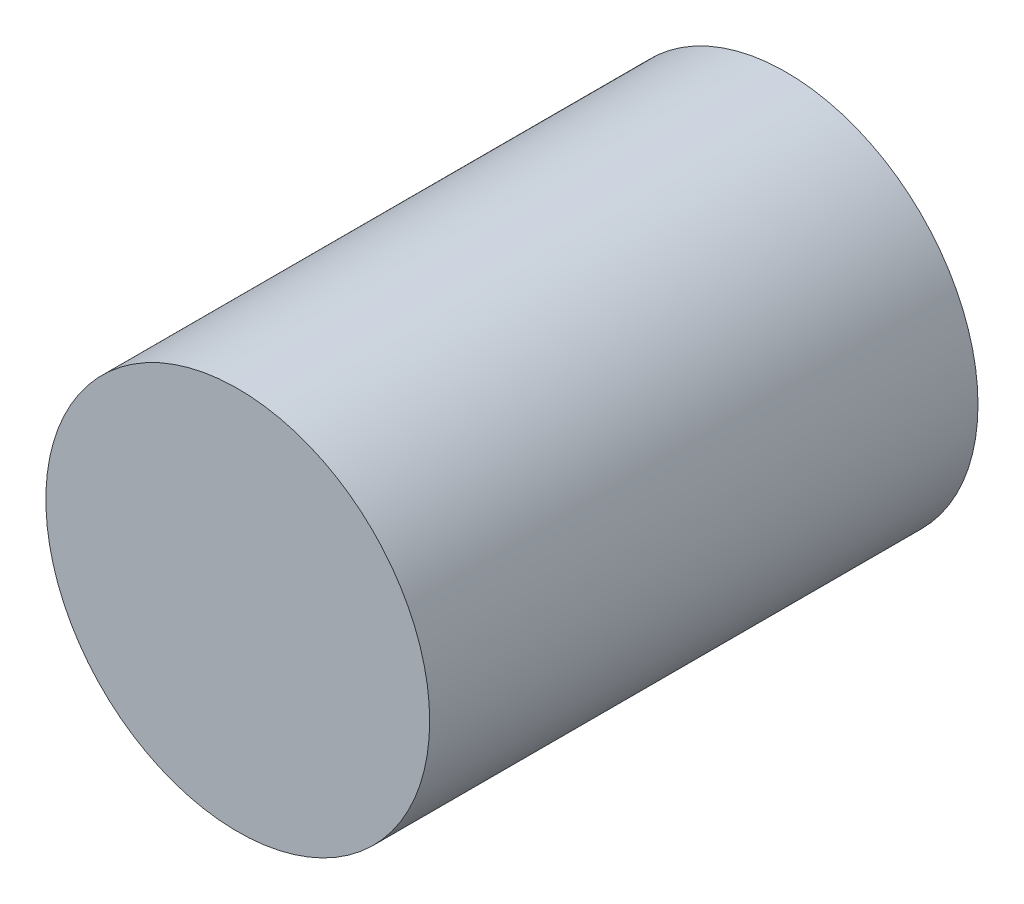
ISO-10303-21;
HEADER;
FILE_DESCRIPTION(('STEP AP214'),'2;1');
FILE_NAME('part.step','',(''),(''),'','','');
FILE_SCHEMA(('AUTOMOTIVE_DESIGN { 1 0 10303 214 1 1 1 1 }'));
ENDSEC;
DATA;
#1=APPLICATION_CONTEXT('core data for automotive mechanical design processes');
#2=APPLICATION_PROTOCOL_DEFINITION('international standard','automotive_design',2000,#1);
#3=PRODUCT_CONTEXT('',#1,'mechanical');
#4=PRODUCT('Part','Part','',(#3));
#5=PRODUCT_RELATED_PRODUCT_CATEGORY('part','',(#4));
#6=PRODUCT_DEFINITION_FORMATION('','',#4);
#7=PRODUCT_DEFINITION_CONTEXT('part definition',#1,'design');
#8=PRODUCT_DEFINITION('design','',#6,#7);
#9=PRODUCT_DEFINITION_SHAPE('','',#8);
#10=(LENGTH_UNIT() NAMED_UNIT(*) SI_UNIT(.MILLI.,.METRE.));
#11=(NAMED_UNIT(*) PLANE_ANGLE_UNIT() SI_UNIT($,.RADIAN.));
#12=(NAMED_UNIT(*) SI_UNIT($,.STERADIAN.) SOLID_ANGLE_UNIT());
#13=UNCERTAINTY_MEASURE_WITH_UNIT(LENGTH_MEASURE(1.E-05),#10,'distance_accuracy_value','');
#14=(GEOMETRIC_REPRESENTATION_CONTEXT(3) GLOBAL_UNCERTAINTY_ASSIGNED_CONTEXT((#13)) GLOBAL_UNIT_ASSIGNED_CONTEXT((#10,
#11,#12)) REPRESENTATION_CONTEXT('',''));
#15=CARTESIAN_POINT('',(0.,0.,0.));
#16=DIRECTION('',(0.,0.,1.));
#17=DIRECTION('',(1.,0.,0.));
#18=AXIS2_PLACEMENT_3D('',#15,#16,#17);
#19=CARTESIAN_POINT('',(0.,0.,10.));
#20=DIRECTION('',(0.,0.,-1.));
#21=DIRECTION('',(-1.,0.,0.));
#22=AXIS2_PLACEMENT_3D('',#19,#20,#21);
#23=CYLINDRICAL_SURFACE('',#22,3.5);
#24=CARTESIAN_POINT('',(0.,0.,10.));
#25=DIRECTION('',(0.,0.,1.));
#26=DIRECTION('',(1.,0.,0.));
#27=AXIS2_PLACEMENT_3D('',#24,#25,#26);
#28=CIRCLE('',#27,3.5);
#29=CARTESIAN_POINT('',(3.5,0.,10.));
#30=VERTEX_POINT('',#29);
#31=EDGE_CURVE('E10',#30,#30,#28,.T.);
#32=ORIENTED_EDGE('',*,*,#31,.F.);
#33=EDGE_LOOP('',(#32));
#34=FACE_BOUND('',#33,.T.);
#35=CARTESIAN_POINT('',(0.,0.,0.));
#36=DIRECTION('',(0.,0.,1.));
#37=DIRECTION('',(1.,0.,0.));
#38=AXIS2_PLACEMENT_3D('',#35,#36,#37);
#39=CIRCLE('',#38,3.5);
#40=CARTESIAN_POINT('',(3.5,0.,0.));
#41=VERTEX_POINT('',#40);
#42=EDGE_CURVE('E34',#41,#41,#39,.T.);
#43=ORIENTED_EDGE('',*,*,#42,.T.);
#44=EDGE_LOOP('',(#43));
#45=FACE_BOUND('',#44,.T.);
#46=ADVANCED_FACE('F31',(#34,#45),#23,.T.);
#47=CARTESIAN_POINT('',(0.,0.,10.));
#48=DIRECTION('',(0.,0.,1.));
#49=DIRECTION('',(1.,0.,0.));
#50=AXIS2_PLACEMENT_3D('',#47,#48,#49);
#51=PLANE('',#50);
#52=ORIENTED_EDGE('',*,*,#31,.T.);
#53=EDGE_LOOP('',(#52));
#54=FACE_BOUND('',#53,.T.);
#55=ADVANCED_FACE('F46',(#54),#51,.T.);
#56=CARTESIAN_POINT('',(0.,0.,0.));
#57=DIRECTION('',(0.,0.,1.));
#58=DIRECTION('',(1.,0.,0.));
#59=AXIS2_PLACEMENT_3D('',#56,#57,#58);
#60=PLANE('',#59);
#61=ORIENTED_EDGE('',*,*,#42,.F.);
#62=EDGE_LOOP('',(#61));
#63=FACE_BOUND('',#62,.T.);
#64=ADVANCED_FACE('F44',(#63),#60,.F.);
#65=CLOSED_SHELL('',(#46,#55,#64));
#66=MANIFOLD_SOLID_BREP('B2',#65);
#67=ADVANCED_BREP_SHAPE_REPRESENTATION('',(#18,#66),#14);
#68=SHAPE_DEFINITION_REPRESENTATION(#9,#67);
ENDSEC;
END-ISO-10303-21;
